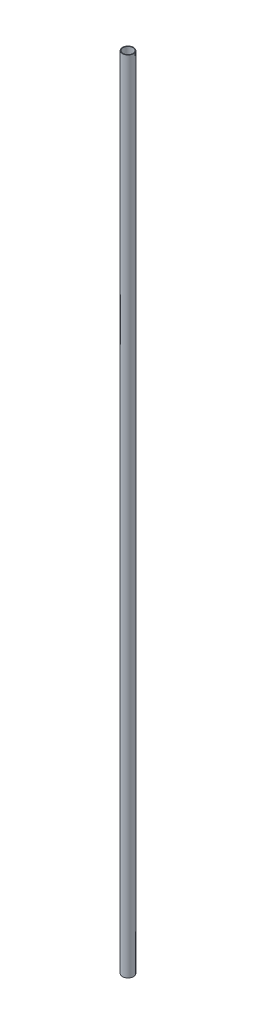
ISO-10303-21;
HEADER;
FILE_DESCRIPTION(('STEP AP214'),'2;1');
FILE_NAME('part.step','',(''),(''),'','','');
FILE_SCHEMA(('AUTOMOTIVE_DESIGN { 1 0 10303 214 1 1 1 1 }'));
ENDSEC;
DATA;
#1=APPLICATION_CONTEXT('core data for automotive mechanical design processes');
#2=APPLICATION_PROTOCOL_DEFINITION('international standard','automotive_design',2000,#1);
#3=PRODUCT_CONTEXT('',#1,'mechanical');
#4=PRODUCT('Part','Part','',(#3));
#5=PRODUCT_RELATED_PRODUCT_CATEGORY('part','',(#4));
#6=PRODUCT_DEFINITION_FORMATION('','',#4);
#7=PRODUCT_DEFINITION_CONTEXT('part definition',#1,'design');
#8=PRODUCT_DEFINITION('design','',#6,#7);
#9=PRODUCT_DEFINITION_SHAPE('','',#8);
#10=(LENGTH_UNIT() NAMED_UNIT(*) SI_UNIT(.MILLI.,.METRE.));
#11=(NAMED_UNIT(*) PLANE_ANGLE_UNIT() SI_UNIT($,.RADIAN.));
#12=(NAMED_UNIT(*) SI_UNIT($,.STERADIAN.) SOLID_ANGLE_UNIT());
#13=UNCERTAINTY_MEASURE_WITH_UNIT(LENGTH_MEASURE(1.E-05),#10,'distance_accuracy_value','');
#14=(GEOMETRIC_REPRESENTATION_CONTEXT(3) GLOBAL_UNCERTAINTY_ASSIGNED_CONTEXT((#13)) GLOBAL_UNIT_ASSIGNED_CONTEXT((#10,
#11,#12)) REPRESENTATION_CONTEXT('',''));
#15=CARTESIAN_POINT('',(0.,0.,0.));
#16=DIRECTION('',(0.,0.,1.));
#17=DIRECTION('',(1.,0.,0.));
#18=AXIS2_PLACEMENT_3D('',#15,#16,#17);
#19=CARTESIAN_POINT('',(0.,2133.6,0.));
#20=DIRECTION('',(0.,1.,0.));
#21=DIRECTION('',(0.,0.,1.));
#22=AXIS2_PLACEMENT_3D('',#19,#20,#21);
#23=PLANE('',#22);
#24=CARTESIAN_POINT('',(0.,2133.6,0.));
#25=DIRECTION('',(0.,1.,0.));
#26=DIRECTION('',(0.,0.,1.));
#27=AXIS2_PLACEMENT_3D('',#24,#25,#26);
#28=CIRCLE('',#27,14.7701);
#29=CARTESIAN_POINT('',(0.,2133.6,14.7701));
#30=VERTEX_POINT('',#29);
#31=EDGE_CURVE('E10',#30,#30,#28,.T.);
#32=ORIENTED_EDGE('',*,*,#31,.T.);
#33=EDGE_LOOP('',(#32));
#34=FACE_BOUND('',#33,.T.);
#35=CARTESIAN_POINT('',(0.,2133.6,0.));
#36=DIRECTION('',(0.,1.,0.));
#37=DIRECTION('',(0.,0.,1.));
#38=AXIS2_PLACEMENT_3D('',#35,#36,#37);
#39=CIRCLE('',#38,13.3223);
#40=CARTESIAN_POINT('',(0.,2133.6,13.3223));
#41=VERTEX_POINT('',#40);
#42=EDGE_CURVE('E53',#41,#41,#39,.T.);
#43=ORIENTED_EDGE('',*,*,#42,.F.);
#44=EDGE_LOOP('',(#43));
#45=FACE_BOUND('',#44,.T.);
#46=ADVANCED_FACE('F41',(#34,#45),#23,.T.);
#47=CARTESIAN_POINT('',(0.,0.,0.));
#48=DIRECTION('',(0.,1.,0.));
#49=DIRECTION('',(0.,0.,1.));
#50=AXIS2_PLACEMENT_3D('',#47,#48,#49);
#51=PLANE('',#50);
#52=CARTESIAN_POINT('',(0.,0.,0.));
#53=DIRECTION('',(0.,1.,0.));
#54=DIRECTION('',(0.,0.,1.));
#55=AXIS2_PLACEMENT_3D('',#52,#53,#54);
#56=CIRCLE('',#55,14.7701);
#57=CARTESIAN_POINT('',(0.,0.,14.7701));
#58=VERTEX_POINT('',#57);
#59=EDGE_CURVE('E45',#58,#58,#56,.T.);
#60=ORIENTED_EDGE('',*,*,#59,.F.);
#61=EDGE_LOOP('',(#60));
#62=FACE_BOUND('',#61,.T.);
#63=CARTESIAN_POINT('',(0.,0.,0.));
#64=DIRECTION('',(0.,1.,0.));
#65=DIRECTION('',(0.,0.,1.));
#66=AXIS2_PLACEMENT_3D('',#63,#64,#65);
#67=CIRCLE('',#66,13.3223);
#68=CARTESIAN_POINT('',(0.,0.,13.3223));
#69=VERTEX_POINT('',#68);
#70=EDGE_CURVE('E55',#69,#69,#67,.T.);
#71=ORIENTED_EDGE('',*,*,#70,.T.);
#72=EDGE_LOOP('',(#71));
#73=FACE_BOUND('',#72,.T.);
#74=ADVANCED_FACE('F66',(#62,#73),#51,.F.);
#75=CARTESIAN_POINT('',(0.,2133.6,0.));
#76=DIRECTION('',(0.,-1.,0.));
#77=DIRECTION('',(0.,0.,-1.));
#78=AXIS2_PLACEMENT_3D('',#75,#76,#77);
#79=CYLINDRICAL_SURFACE('',#78,14.7701);
#80=ORIENTED_EDGE('',*,*,#31,.F.);
#81=EDGE_LOOP('',(#80));
#82=FACE_BOUND('',#81,.T.);
#83=ORIENTED_EDGE('',*,*,#59,.T.);
#84=EDGE_LOOP('',(#83));
#85=FACE_BOUND('',#84,.T.);
#86=ADVANCED_FACE('F43',(#82,#85),#79,.T.);
#87=CARTESIAN_POINT('',(0.,2133.6,0.));
#88=DIRECTION('',(0.,-1.,0.));
#89=DIRECTION('',(0.,0.,-1.));
#90=AXIS2_PLACEMENT_3D('',#87,#88,#89);
#91=CYLINDRICAL_SURFACE('',#90,13.3223);
#92=ORIENTED_EDGE('',*,*,#42,.T.);
#93=EDGE_LOOP('',(#92));
#94=FACE_BOUND('',#93,.T.);
#95=ORIENTED_EDGE('',*,*,#70,.F.);
#96=EDGE_LOOP('',(#95));
#97=FACE_BOUND('',#96,.T.);
#98=ADVANCED_FACE('F62',(#94,#97),#91,.F.);
#99=CLOSED_SHELL('',(#46,#74,#86,#98));
#100=MANIFOLD_SOLID_BREP('B2',#99);
#101=ADVANCED_BREP_SHAPE_REPRESENTATION('',(#18,#100),#14);
#102=SHAPE_DEFINITION_REPRESENTATION(#9,#101);
ENDSEC;
END-ISO-10303-21;
